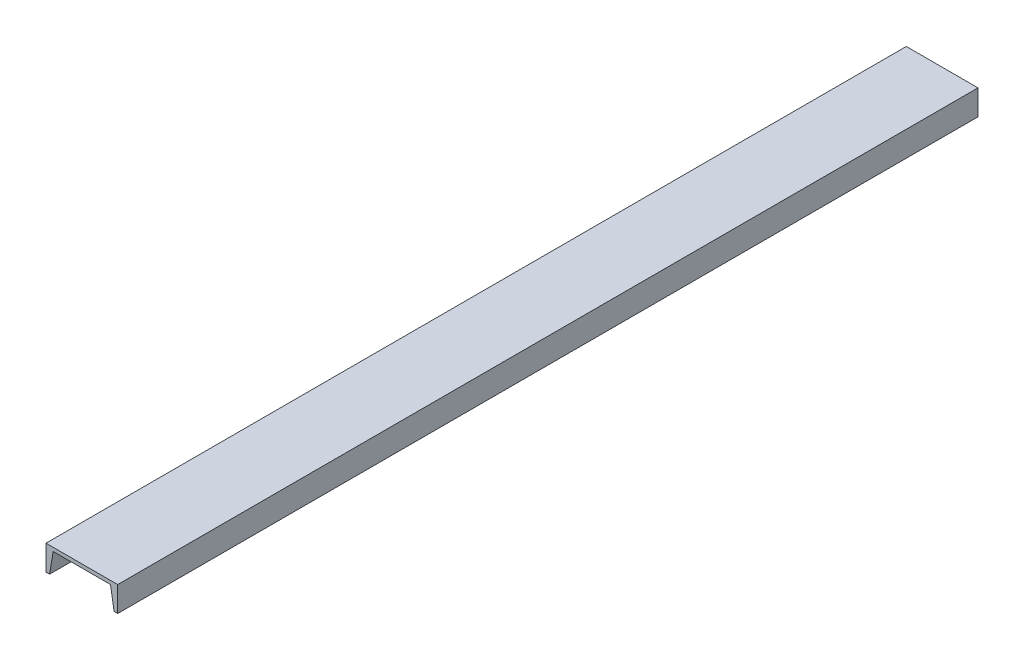
ISO-10303-21;
HEADER;
FILE_DESCRIPTION(('STEP AP214'),'2;1');
FILE_NAME('part.step','',(''),(''),'','','');
FILE_SCHEMA(('AUTOMOTIVE_DESIGN { 1 0 10303 214 1 1 1 1 }'));
ENDSEC;
DATA;
#1=APPLICATION_CONTEXT('core data for automotive mechanical design processes');
#2=APPLICATION_PROTOCOL_DEFINITION('international standard','automotive_design',2000,#1);
#3=PRODUCT_CONTEXT('',#1,'mechanical');
#4=PRODUCT('Part','Part','',(#3));
#5=PRODUCT_RELATED_PRODUCT_CATEGORY('part','',(#4));
#6=PRODUCT_DEFINITION_FORMATION('','',#4);
#7=PRODUCT_DEFINITION_CONTEXT('part definition',#1,'design');
#8=PRODUCT_DEFINITION('design','',#6,#7);
#9=PRODUCT_DEFINITION_SHAPE('','',#8);
#10=(LENGTH_UNIT() NAMED_UNIT(*) SI_UNIT(.MILLI.,.METRE.));
#11=(NAMED_UNIT(*) PLANE_ANGLE_UNIT() SI_UNIT($,.RADIAN.));
#12=(NAMED_UNIT(*) SI_UNIT($,.STERADIAN.) SOLID_ANGLE_UNIT());
#13=UNCERTAINTY_MEASURE_WITH_UNIT(LENGTH_MEASURE(1.E-05),#10,'distance_accuracy_value','');
#14=(GEOMETRIC_REPRESENTATION_CONTEXT(3) GLOBAL_UNCERTAINTY_ASSIGNED_CONTEXT((#13)) GLOBAL_UNIT_ASSIGNED_CONTEXT((#10,
#11,#12)) REPRESENTATION_CONTEXT('',''));
#15=CARTESIAN_POINT('',(0.,0.,0.));
#16=DIRECTION('',(0.,0.,1.));
#17=DIRECTION('',(1.,0.,0.));
#18=AXIS2_PLACEMENT_3D('',#15,#16,#17);
#19=CARTESIAN_POINT('',(0.,-44.45,1524.));
#20=DIRECTION('',(1.,0.,0.));
#21=DIRECTION('',(0.,0.,-1.));
#22=AXIS2_PLACEMENT_3D('',#19,#20,#21);
#23=PLANE('',#22);
#24=DIRECTION('',(0.,-1.,0.));
#25=VECTOR('',#24,1.);
#26=CARTESIAN_POINT('',(0.,-44.45,0.));
#27=LINE('',#26,#25);
#28=CARTESIAN_POINT('',(0.,0.,0.));
#29=VERTEX_POINT('',#28);
#30=CARTESIAN_POINT('',(0.,-44.45,0.));
#31=VERTEX_POINT('',#30);
#32=EDGE_CURVE('E146',#29,#31,#27,.T.);
#33=ORIENTED_EDGE('',*,*,#32,.T.);
#34=DIRECTION('',(0.,0.,-1.));
#35=VECTOR('',#34,1.);
#36=CARTESIAN_POINT('',(0.,-44.45,1524.));
#37=LINE('',#36,#35);
#38=CARTESIAN_POINT('',(0.,-44.45,1524.));
#39=VERTEX_POINT('',#38);
#40=EDGE_CURVE('E11',#39,#31,#37,.T.);
#41=ORIENTED_EDGE('',*,*,#40,.F.);
#42=DIRECTION('',(0.,-1.,0.));
#43=VECTOR('',#42,1.);
#44=CARTESIAN_POINT('',(0.,-44.45,1524.));
#45=LINE('',#44,#43);
#46=CARTESIAN_POINT('',(0.,0.,1524.));
#47=VERTEX_POINT('',#46);
#48=EDGE_CURVE('E168',#47,#39,#45,.T.);
#49=ORIENTED_EDGE('',*,*,#48,.F.);
#50=DIRECTION('',(0.,0.,-1.));
#51=VECTOR('',#50,1.);
#52=CARTESIAN_POINT('',(0.,0.,1524.));
#53=LINE('',#52,#51);
#54=EDGE_CURVE('E142',#47,#29,#53,.T.);
#55=ORIENTED_EDGE('',*,*,#54,.T.);
#56=EDGE_LOOP('',(#33,#41,#49,#55));
#57=FACE_BOUND('',#56,.T.);
#58=ADVANCED_FACE('F43',(#57),#23,.F.);
#59=CARTESIAN_POINT('',(6.35,-44.45,1524.));
#60=DIRECTION('',(0.,1.,0.));
#61=DIRECTION('',(0.,0.,1.));
#62=AXIS2_PLACEMENT_3D('',#59,#60,#61);
#63=PLANE('',#62);
#64=DIRECTION('',(1.,0.,0.));
#65=VECTOR('',#64,1.);
#66=CARTESIAN_POINT('',(6.35,-44.45,0.));
#67=LINE('',#66,#65);
#68=CARTESIAN_POINT('',(6.35,-44.45,0.));
#69=VERTEX_POINT('',#68);
#70=EDGE_CURVE('E150',#31,#69,#67,.T.);
#71=ORIENTED_EDGE('',*,*,#70,.T.);
#72=DIRECTION('',(0.,0.,-1.));
#73=VECTOR('',#72,1.);
#74=CARTESIAN_POINT('',(6.35,-44.45,1524.));
#75=LINE('',#74,#73);
#76=CARTESIAN_POINT('',(6.35,-44.45,1524.));
#77=VERTEX_POINT('',#76);
#78=EDGE_CURVE('E52',#77,#69,#75,.T.);
#79=ORIENTED_EDGE('',*,*,#78,.F.);
#80=DIRECTION('',(1.,0.,0.));
#81=VECTOR('',#80,1.);
#82=CARTESIAN_POINT('',(6.35,-44.45,1524.));
#83=LINE('',#82,#81);
#84=EDGE_CURVE('E103',#39,#77,#83,.T.);
#85=ORIENTED_EDGE('',*,*,#84,.F.);
#86=ORIENTED_EDGE('',*,*,#40,.T.);
#87=EDGE_LOOP('',(#71,#79,#85,#86));
#88=FACE_BOUND('',#87,.T.);
#89=ADVANCED_FACE('F220',(#88),#63,.F.);
#90=CARTESIAN_POINT('',(12.7,-6.35000000000002,1524.));
#91=DIRECTION('',(-0.986393923832144,0.164398987305357,0.));
#92=DIRECTION('',(-0.164398987305357,-0.986393923832144,0.));
#93=AXIS2_PLACEMENT_3D('',#90,#91,#92);
#94=PLANE('',#93);
#95=DIRECTION('',(0.164398987305357,0.986393923832144,0.));
#96=VECTOR('',#95,1.);
#97=CARTESIAN_POINT('',(12.7,-6.35000000000002,0.));
#98=LINE('',#97,#96);
#99=CARTESIAN_POINT('',(12.7,-6.35000000000002,0.));
#100=VERTEX_POINT('',#99);
#101=EDGE_CURVE('E153',#69,#100,#98,.T.);
#102=ORIENTED_EDGE('',*,*,#101,.T.);
#103=DIRECTION('',(0.,0.,-1.));
#104=VECTOR('',#103,1.);
#105=CARTESIAN_POINT('',(12.7,-6.35000000000002,1524.));
#106=LINE('',#105,#104);
#107=CARTESIAN_POINT('',(12.7,-6.35000000000002,1524.));
#108=VERTEX_POINT('',#107);
#109=EDGE_CURVE('E179',#108,#100,#106,.T.);
#110=ORIENTED_EDGE('',*,*,#109,.F.);
#111=DIRECTION('',(0.164398987305357,0.986393923832144,0.));
#112=VECTOR('',#111,1.);
#113=CARTESIAN_POINT('',(12.7,-6.35000000000002,1524.));
#114=LINE('',#113,#112);
#115=EDGE_CURVE('E191',#77,#108,#114,.T.);
#116=ORIENTED_EDGE('',*,*,#115,.F.);
#117=ORIENTED_EDGE('',*,*,#78,.T.);
#118=EDGE_LOOP('',(#102,#110,#116,#117));
#119=FACE_BOUND('',#118,.T.);
#120=ADVANCED_FACE('F189',(#119),#94,.F.);
#121=CARTESIAN_POINT('',(114.3,-6.35,1524.));
#122=DIRECTION('',(0.,1.,0.));
#123=DIRECTION('',(-1.,0.,0.));
#124=AXIS2_PLACEMENT_3D('',#121,#122,#123);
#125=PLANE('',#124);
#126=DIRECTION('',(1.,0.,0.));
#127=VECTOR('',#126,1.);
#128=CARTESIAN_POINT('',(114.3,-6.35,0.));
#129=LINE('',#128,#127);
#130=CARTESIAN_POINT('',(114.3,-6.35,0.));
#131=VERTEX_POINT('',#130);
#132=EDGE_CURVE('E156',#100,#131,#129,.T.);
#133=ORIENTED_EDGE('',*,*,#132,.T.);
#134=DIRECTION('',(0.,0.,-1.));
#135=VECTOR('',#134,1.);
#136=CARTESIAN_POINT('',(114.3,-6.35,1524.));
#137=LINE('',#136,#135);
#138=CARTESIAN_POINT('',(114.3,-6.35,1524.));
#139=VERTEX_POINT('',#138);
#140=EDGE_CURVE('E175',#139,#131,#137,.T.);
#141=ORIENTED_EDGE('',*,*,#140,.F.);
#142=DIRECTION('',(1.,0.,0.));
#143=VECTOR('',#142,1.);
#144=CARTESIAN_POINT('',(114.3,-6.35,1524.));
#145=LINE('',#144,#143);
#146=EDGE_CURVE('E204',#108,#139,#145,.T.);
#147=ORIENTED_EDGE('',*,*,#146,.F.);
#148=ORIENTED_EDGE('',*,*,#109,.T.);
#149=EDGE_LOOP('',(#133,#141,#147,#148));
#150=FACE_BOUND('',#149,.T.);
#151=ADVANCED_FACE('F199',(#150),#125,.F.);
#152=CARTESIAN_POINT('',(120.65,-44.45,1524.));
#153=DIRECTION('',(0.986393923832144,0.164398987305357,0.));
#154=DIRECTION('',(-0.164398987305358,0.986393923832144,0.));
#155=AXIS2_PLACEMENT_3D('',#152,#153,#154);
#156=PLANE('',#155);
#157=DIRECTION('',(0.164398987305357,-0.986393923832144,0.));
#158=VECTOR('',#157,1.);
#159=CARTESIAN_POINT('',(120.65,-44.45,0.));
#160=LINE('',#159,#158);
#161=CARTESIAN_POINT('',(120.65,-44.45,0.));
#162=VERTEX_POINT('',#161);
#163=EDGE_CURVE('E159',#131,#162,#160,.T.);
#164=ORIENTED_EDGE('',*,*,#163,.T.);
#165=DIRECTION('',(0.,0.,-1.));
#166=VECTOR('',#165,1.);
#167=CARTESIAN_POINT('',(120.65,-44.45,1524.));
#168=LINE('',#167,#166);
#169=CARTESIAN_POINT('',(120.65,-44.45,1524.));
#170=VERTEX_POINT('',#169);
#171=EDGE_CURVE('E133',#170,#162,#168,.T.);
#172=ORIENTED_EDGE('',*,*,#171,.F.);
#173=DIRECTION('',(0.164398987305357,-0.986393923832144,0.));
#174=VECTOR('',#173,1.);
#175=CARTESIAN_POINT('',(120.65,-44.45,1524.));
#176=LINE('',#175,#174);
#177=EDGE_CURVE('E122',#139,#170,#176,.T.);
#178=ORIENTED_EDGE('',*,*,#177,.F.);
#179=ORIENTED_EDGE('',*,*,#140,.T.);
#180=EDGE_LOOP('',(#164,#172,#178,#179));
#181=FACE_BOUND('',#180,.T.);
#182=ADVANCED_FACE('F202',(#181),#156,.F.);
#183=CARTESIAN_POINT('',(127.,-44.45,1524.));
#184=DIRECTION('',(0.,1.,0.));
#185=DIRECTION('',(-1.,0.,0.));
#186=AXIS2_PLACEMENT_3D('',#183,#184,#185);
#187=PLANE('',#186);
#188=DIRECTION('',(1.,0.,0.));
#189=VECTOR('',#188,1.);
#190=CARTESIAN_POINT('',(127.,-44.45,0.));
#191=LINE('',#190,#189);
#192=CARTESIAN_POINT('',(127.,-44.45,0.));
#193=VERTEX_POINT('',#192);
#194=EDGE_CURVE('E131',#162,#193,#191,.T.);
#195=ORIENTED_EDGE('',*,*,#194,.T.);
#196=DIRECTION('',(0.,0.,-1.));
#197=VECTOR('',#196,1.);
#198=CARTESIAN_POINT('',(127.,-44.45,1524.));
#199=LINE('',#198,#197);
#200=CARTESIAN_POINT('',(127.,-44.45,1524.));
#201=VERTEX_POINT('',#200);
#202=EDGE_CURVE('E128',#201,#193,#199,.T.);
#203=ORIENTED_EDGE('',*,*,#202,.F.);
#204=DIRECTION('',(1.,0.,0.));
#205=VECTOR('',#204,1.);
#206=CARTESIAN_POINT('',(127.,-44.45,1524.));
#207=LINE('',#206,#205);
#208=EDGE_CURVE('E116',#170,#201,#207,.T.);
#209=ORIENTED_EDGE('',*,*,#208,.F.);
#210=ORIENTED_EDGE('',*,*,#171,.T.);
#211=EDGE_LOOP('',(#195,#203,#209,#210));
#212=FACE_BOUND('',#211,.T.);
#213=ADVANCED_FACE('F129',(#212),#187,.F.);
#214=CARTESIAN_POINT('',(127.,0.,1524.));
#215=DIRECTION('',(-1.,0.,0.));
#216=DIRECTION('',(0.,0.,1.));
#217=AXIS2_PLACEMENT_3D('',#214,#215,#216);
#218=PLANE('',#217);
#219=DIRECTION('',(0.,1.,0.));
#220=VECTOR('',#219,1.);
#221=CARTESIAN_POINT('',(127.,0.,0.));
#222=LINE('',#221,#220);
#223=CARTESIAN_POINT('',(127.,0.,0.));
#224=VERTEX_POINT('',#223);
#225=EDGE_CURVE('E89',#193,#224,#222,.T.);
#226=ORIENTED_EDGE('',*,*,#225,.T.);
#227=DIRECTION('',(0.,0.,-1.));
#228=VECTOR('',#227,1.);
#229=CARTESIAN_POINT('',(127.,0.,1524.));
#230=LINE('',#229,#228);
#231=CARTESIAN_POINT('',(127.,0.,1524.));
#232=VERTEX_POINT('',#231);
#233=EDGE_CURVE('E134',#232,#224,#230,.T.);
#234=ORIENTED_EDGE('',*,*,#233,.F.);
#235=DIRECTION('',(0.,1.,0.));
#236=VECTOR('',#235,1.);
#237=CARTESIAN_POINT('',(127.,0.,1524.));
#238=LINE('',#237,#236);
#239=EDGE_CURVE('E120',#201,#232,#238,.T.);
#240=ORIENTED_EDGE('',*,*,#239,.F.);
#241=ORIENTED_EDGE('',*,*,#202,.T.);
#242=EDGE_LOOP('',(#226,#234,#240,#241));
#243=FACE_BOUND('',#242,.T.);
#244=ADVANCED_FACE('F136',(#243),#218,.F.);
#245=CARTESIAN_POINT('',(0.,0.,1524.));
#246=DIRECTION('',(0.,-1.,0.));
#247=DIRECTION('',(0.,0.,-1.));
#248=AXIS2_PLACEMENT_3D('',#245,#246,#247);
#249=PLANE('',#248);
#250=DIRECTION('',(-1.,0.,0.));
#251=VECTOR('',#250,1.);
#252=CARTESIAN_POINT('',(0.,0.,0.));
#253=LINE('',#252,#251);
#254=EDGE_CURVE('E95',#224,#29,#253,.T.);
#255=ORIENTED_EDGE('',*,*,#254,.T.);
#256=ORIENTED_EDGE('',*,*,#54,.F.);
#257=DIRECTION('',(-1.,0.,0.));
#258=VECTOR('',#257,1.);
#259=CARTESIAN_POINT('',(0.,0.,1524.));
#260=LINE('',#259,#258);
#261=EDGE_CURVE('E60',#232,#47,#260,.T.);
#262=ORIENTED_EDGE('',*,*,#261,.F.);
#263=ORIENTED_EDGE('',*,*,#233,.T.);
#264=EDGE_LOOP('',(#255,#256,#262,#263));
#265=FACE_BOUND('',#264,.T.);
#266=ADVANCED_FACE('F236',(#265),#249,.F.);
#267=CARTESIAN_POINT('',(0.,0.,1524.));
#268=DIRECTION('',(0.,0.,-1.));
#269=DIRECTION('',(-1.,0.,0.));
#270=AXIS2_PLACEMENT_3D('',#267,#268,#269);
#271=PLANE('',#270);
#272=ORIENTED_EDGE('',*,*,#48,.T.);
#273=ORIENTED_EDGE('',*,*,#84,.T.);
#274=ORIENTED_EDGE('',*,*,#115,.T.);
#275=ORIENTED_EDGE('',*,*,#146,.T.);
#276=ORIENTED_EDGE('',*,*,#177,.T.);
#277=ORIENTED_EDGE('',*,*,#208,.T.);
#278=ORIENTED_EDGE('',*,*,#239,.T.);
#279=ORIENTED_EDGE('',*,*,#261,.T.);
#280=EDGE_LOOP('',(#272,#273,#274,#275,#276,#277,#278,#279));
#281=FACE_BOUND('',#280,.T.);
#282=ADVANCED_FACE('F118',(#281),#271,.F.);
#283=CARTESIAN_POINT('',(0.,0.,0.));
#284=DIRECTION('',(0.,0.,-1.));
#285=DIRECTION('',(-1.,0.,0.));
#286=AXIS2_PLACEMENT_3D('',#283,#284,#285);
#287=PLANE('',#286);
#288=ORIENTED_EDGE('',*,*,#32,.F.);
#289=ORIENTED_EDGE('',*,*,#254,.F.);
#290=ORIENTED_EDGE('',*,*,#225,.F.);
#291=ORIENTED_EDGE('',*,*,#194,.F.);
#292=ORIENTED_EDGE('',*,*,#163,.F.);
#293=ORIENTED_EDGE('',*,*,#132,.F.);
#294=ORIENTED_EDGE('',*,*,#101,.F.);
#295=ORIENTED_EDGE('',*,*,#70,.F.);
#296=EDGE_LOOP('',(#288,#289,#290,#291,#292,#293,#294,#295));
#297=FACE_BOUND('',#296,.T.);
#298=ADVANCED_FACE('F195',(#297),#287,.T.);
#299=CLOSED_SHELL('',(#58,#89,#120,#151,#182,#213,#244,#266,#282,#298));
#300=MANIFOLD_SOLID_BREP('B2',#299);
#301=ADVANCED_BREP_SHAPE_REPRESENTATION('',(#18,#300),#14);
#302=SHAPE_DEFINITION_REPRESENTATION(#9,#301);
ENDSEC;
END-ISO-10303-21;
